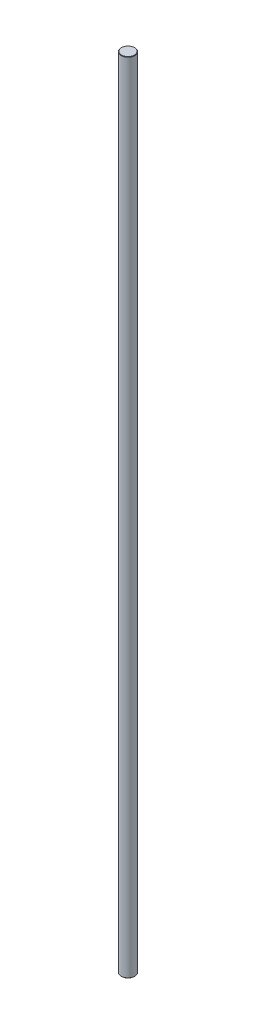
ISO-10303-21;
HEADER;
FILE_DESCRIPTION(('STEP AP214'),'2;1');
FILE_NAME('part.step','',(''),(''),'','','');
FILE_SCHEMA(('AUTOMOTIVE_DESIGN { 1 0 10303 214 1 1 1 1 }'));
ENDSEC;
DATA;
#1=APPLICATION_CONTEXT('core data for automotive mechanical design processes');
#2=APPLICATION_PROTOCOL_DEFINITION('international standard','automotive_design',2000,#1);
#3=PRODUCT_CONTEXT('',#1,'mechanical');
#4=PRODUCT('Part','Part','',(#3));
#5=PRODUCT_RELATED_PRODUCT_CATEGORY('part','',(#4));
#6=PRODUCT_DEFINITION_FORMATION('','',#4);
#7=PRODUCT_DEFINITION_CONTEXT('part definition',#1,'design');
#8=PRODUCT_DEFINITION('design','',#6,#7);
#9=PRODUCT_DEFINITION_SHAPE('','',#8);
#10=(LENGTH_UNIT() NAMED_UNIT(*) SI_UNIT(.MILLI.,.METRE.));
#11=(NAMED_UNIT(*) PLANE_ANGLE_UNIT() SI_UNIT($,.RADIAN.));
#12=(NAMED_UNIT(*) SI_UNIT($,.STERADIAN.) SOLID_ANGLE_UNIT());
#13=UNCERTAINTY_MEASURE_WITH_UNIT(LENGTH_MEASURE(1.E-05),#10,'distance_accuracy_value','');
#14=(GEOMETRIC_REPRESENTATION_CONTEXT(3) GLOBAL_UNCERTAINTY_ASSIGNED_CONTEXT((#13)) GLOBAL_UNIT_ASSIGNED_CONTEXT((#10,
#11,#12)) REPRESENTATION_CONTEXT('',''));
#15=CARTESIAN_POINT('',(0.,0.,0.));
#16=DIRECTION('',(0.,0.,1.));
#17=DIRECTION('',(1.,0.,0.));
#18=AXIS2_PLACEMENT_3D('',#15,#16,#17);
#19=CARTESIAN_POINT('',(0.,235.,0.));
#20=DIRECTION('',(0.,-1.,0.));
#21=DIRECTION('',(0.,0.,-1.));
#22=AXIS2_PLACEMENT_3D('',#19,#20,#21);
#23=CYLINDRICAL_SURFACE('',#22,4.);
#24=CARTESIAN_POINT('',(0.,-234.8,0.));
#25=DIRECTION('',(0.,1.,0.));
#26=DIRECTION('',(0.,0.,1.));
#27=AXIS2_PLACEMENT_3D('',#24,#25,#26);
#28=CIRCLE('',#27,4.);
#29=CARTESIAN_POINT('',(0.,-234.8,4.));
#30=VERTEX_POINT('',#29);
#31=EDGE_CURVE('E44',#30,#30,#28,.T.);
#32=ORIENTED_EDGE('',*,*,#31,.T.);
#33=EDGE_LOOP('',(#32));
#34=FACE_BOUND('',#33,.T.);
#35=CARTESIAN_POINT('',(0.,234.8,0.));
#36=DIRECTION('',(0.,1.,0.));
#37=DIRECTION('',(0.,0.,1.));
#38=AXIS2_PLACEMENT_3D('',#35,#36,#37);
#39=CIRCLE('',#38,4.);
#40=CARTESIAN_POINT('',(0.,234.8,4.));
#41=VERTEX_POINT('',#40);
#42=EDGE_CURVE('E48',#41,#41,#39,.F.);
#43=ORIENTED_EDGE('',*,*,#42,.T.);
#44=EDGE_LOOP('',(#43));
#45=FACE_BOUND('',#44,.T.);
#46=ADVANCED_FACE('F33',(#34,#45),#23,.T.);
#47=CARTESIAN_POINT('',(0.,235.,0.));
#48=DIRECTION('',(0.,1.,0.));
#49=DIRECTION('',(0.,0.,1.));
#50=AXIS2_PLACEMENT_3D('',#47,#48,#49);
#51=PLANE('',#50);
#52=CARTESIAN_POINT('',(0.,235.,0.));
#53=DIRECTION('',(0.,1.,0.));
#54=DIRECTION('',(0.,0.,1.));
#55=AXIS2_PLACEMENT_3D('',#52,#53,#54);
#56=CIRCLE('',#55,3.79999999999997);
#57=CARTESIAN_POINT('',(0.,235.,3.79999999999997));
#58=VERTEX_POINT('',#57);
#59=EDGE_CURVE('E10',#58,#58,#56,.T.);
#60=ORIENTED_EDGE('',*,*,#59,.T.);
#61=EDGE_LOOP('',(#60));
#62=FACE_BOUND('',#61,.T.);
#63=ADVANCED_FACE('F64',(#62),#51,.T.);
#64=CARTESIAN_POINT('',(0.,-235.,0.));
#65=DIRECTION('',(0.,1.,0.));
#66=DIRECTION('',(0.,0.,1.));
#67=AXIS2_PLACEMENT_3D('',#64,#65,#66);
#68=PLANE('',#67);
#69=CARTESIAN_POINT('',(0.,-235.,0.));
#70=DIRECTION('',(0.,1.,0.));
#71=DIRECTION('',(0.,0.,1.));
#72=AXIS2_PLACEMENT_3D('',#69,#70,#71);
#73=CIRCLE('',#72,3.80000000000008);
#74=CARTESIAN_POINT('',(0.,-235.,3.80000000000008));
#75=VERTEX_POINT('',#74);
#76=EDGE_CURVE('E40',#75,#75,#73,.F.);
#77=ORIENTED_EDGE('',*,*,#76,.T.);
#78=EDGE_LOOP('',(#77));
#79=FACE_BOUND('',#78,.T.);
#80=ADVANCED_FACE('F61',(#79),#68,.F.);
#81=CARTESIAN_POINT('',(0.,-234.8,0.));
#82=DIRECTION('',(0.,1.,0.));
#83=DIRECTION('',(0.,0.,1.));
#84=AXIS2_PLACEMENT_3D('',#81,#82,#83);
#85=CONICAL_SURFACE('',#84,4.,0.785398163397301);
#86=ORIENTED_EDGE('',*,*,#76,.F.);
#87=EDGE_LOOP('',(#86));
#88=FACE_BOUND('',#87,.T.);
#89=ORIENTED_EDGE('',*,*,#31,.F.);
#90=EDGE_LOOP('',(#89));
#91=FACE_BOUND('',#90,.T.);
#92=ADVANCED_FACE('F57',(#88,#91),#85,.T.);
#93=CARTESIAN_POINT('',(0.,235.,0.));
#94=DIRECTION('',(0.,-1.,0.));
#95=DIRECTION('',(0.,0.,-1.));
#96=AXIS2_PLACEMENT_3D('',#93,#94,#95);
#97=CONICAL_SURFACE('',#96,3.79999999999997,0.785398163397509);
#98=ORIENTED_EDGE('',*,*,#42,.F.);
#99=EDGE_LOOP('',(#98));
#100=FACE_BOUND('',#99,.T.);
#101=ORIENTED_EDGE('',*,*,#59,.F.);
#102=EDGE_LOOP('',(#101));
#103=FACE_BOUND('',#102,.T.);
#104=ADVANCED_FACE('F35',(#100,#103),#97,.T.);
#105=CLOSED_SHELL('',(#46,#63,#80,#92,#104));
#106=MANIFOLD_SOLID_BREP('B2',#105);
#107=ADVANCED_BREP_SHAPE_REPRESENTATION('',(#18,#106),#14);
#108=SHAPE_DEFINITION_REPRESENTATION(#9,#107);
ENDSEC;
END-ISO-10303-21;
